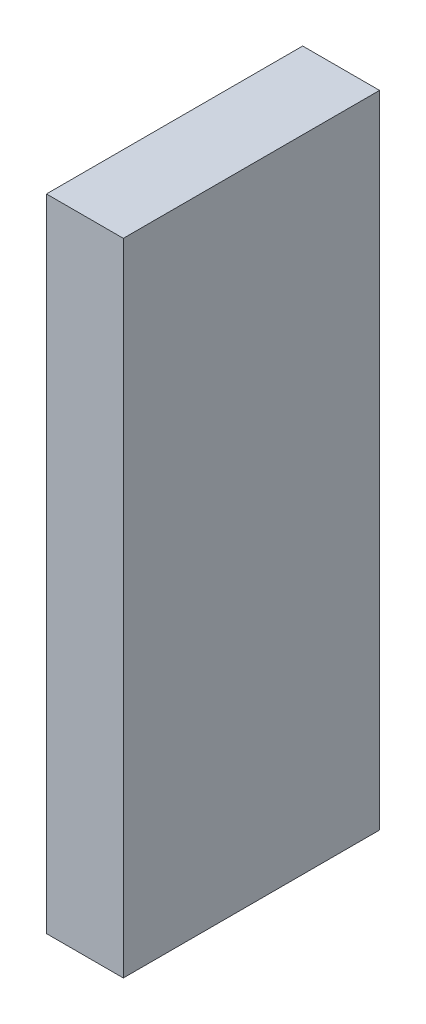
ISO-10303-21;
HEADER;
FILE_DESCRIPTION(('STEP AP214'),'2;1');
FILE_NAME('part.step','',(''),(''),'','','');
FILE_SCHEMA(('AUTOMOTIVE_DESIGN { 1 0 10303 214 1 1 1 1 }'));
ENDSEC;
DATA;
#1=APPLICATION_CONTEXT('core data for automotive mechanical design processes');
#2=APPLICATION_PROTOCOL_DEFINITION('international standard','automotive_design',2000,#1);
#3=PRODUCT_CONTEXT('',#1,'mechanical');
#4=PRODUCT('Part','Part','',(#3));
#5=PRODUCT_RELATED_PRODUCT_CATEGORY('part','',(#4));
#6=PRODUCT_DEFINITION_FORMATION('','',#4);
#7=PRODUCT_DEFINITION_CONTEXT('part definition',#1,'design');
#8=PRODUCT_DEFINITION('design','',#6,#7);
#9=PRODUCT_DEFINITION_SHAPE('','',#8);
#10=(LENGTH_UNIT() NAMED_UNIT(*) SI_UNIT(.MILLI.,.METRE.));
#11=(NAMED_UNIT(*) PLANE_ANGLE_UNIT() SI_UNIT($,.RADIAN.));
#12=(NAMED_UNIT(*) SI_UNIT($,.STERADIAN.) SOLID_ANGLE_UNIT());
#13=UNCERTAINTY_MEASURE_WITH_UNIT(LENGTH_MEASURE(1.E-05),#10,'distance_accuracy_value','');
#14=(GEOMETRIC_REPRESENTATION_CONTEXT(3) GLOBAL_UNCERTAINTY_ASSIGNED_CONTEXT((#13)) GLOBAL_UNIT_ASSIGNED_CONTEXT((#10,
#11,#12)) REPRESENTATION_CONTEXT('',''));
#15=CARTESIAN_POINT('',(0.,0.,0.));
#16=DIRECTION('',(0.,0.,1.));
#17=DIRECTION('',(1.,0.,0.));
#18=AXIS2_PLACEMENT_3D('',#15,#16,#17);
#19=CARTESIAN_POINT('',(0.,25.,56.1884162782189));
#20=DIRECTION('',(0.,0.,1.));
#21=DIRECTION('',(1.,0.,0.));
#22=AXIS2_PLACEMENT_3D('',#19,#20,#21);
#23=PLANE('',#22);
#24=DIRECTION('',(-1.,0.,0.));
#25=VECTOR('',#24,1.);
#26=CARTESIAN_POINT('',(0.,0.,56.1884162782189));
#27=LINE('',#26,#25);
#28=CARTESIAN_POINT('',(-6.62971669111983,0.,56.1884162782189));
#29=VERTEX_POINT('',#28);
#30=CARTESIAN_POINT('',(-9.62971669111982,0.,56.1884162782189));
#31=VERTEX_POINT('',#30);
#32=EDGE_CURVE('E98',#29,#31,#27,.T.);
#33=ORIENTED_EDGE('',*,*,#32,.T.);
#34=DIRECTION('',(0.,-1.,0.));
#35=VECTOR('',#34,1.);
#36=CARTESIAN_POINT('',(-9.62971669111982,25.,56.1884162782189));
#37=LINE('',#36,#35);
#38=CARTESIAN_POINT('',(-9.62971669111982,25.,56.1884162782189));
#39=VERTEX_POINT('',#38);
#40=EDGE_CURVE('E11',#39,#31,#37,.T.);
#41=ORIENTED_EDGE('',*,*,#40,.F.);
#42=DIRECTION('',(-1.,0.,0.));
#43=VECTOR('',#42,1.);
#44=CARTESIAN_POINT('',(0.,25.,56.1884162782189));
#45=LINE('',#44,#43);
#46=CARTESIAN_POINT('',(-6.62971669111983,25.,56.1884162782189));
#47=VERTEX_POINT('',#46);
#48=EDGE_CURVE('E84',#47,#39,#45,.T.);
#49=ORIENTED_EDGE('',*,*,#48,.F.);
#50=DIRECTION('',(0.,-1.,0.));
#51=VECTOR('',#50,1.);
#52=CARTESIAN_POINT('',(-6.62971669111983,25.,56.1884162782189));
#53=LINE('',#52,#51);
#54=EDGE_CURVE('E51',#47,#29,#53,.T.);
#55=ORIENTED_EDGE('',*,*,#54,.T.);
#56=EDGE_LOOP('',(#33,#41,#49,#55));
#57=FACE_BOUND('',#56,.T.);
#58=ADVANCED_FACE('F35',(#57),#23,.F.);
#59=CARTESIAN_POINT('',(-9.62971669111984,25.,0.));
#60=DIRECTION('',(1.,0.,0.));
#61=DIRECTION('',(0.,0.,-1.));
#62=AXIS2_PLACEMENT_3D('',#59,#60,#61);
#63=PLANE('',#62);
#64=DIRECTION('',(0.,0.,1.));
#65=VECTOR('',#64,1.);
#66=CARTESIAN_POINT('',(-9.62971669111984,0.,0.));
#67=LINE('',#66,#65);
#68=CARTESIAN_POINT('',(-9.62971669111982,0.,66.1884162782189));
#69=VERTEX_POINT('',#68);
#70=EDGE_CURVE('E89',#31,#69,#67,.T.);
#71=ORIENTED_EDGE('',*,*,#70,.T.);
#72=DIRECTION('',(0.,-1.,0.));
#73=VECTOR('',#72,1.);
#74=CARTESIAN_POINT('',(-9.62971669111982,25.,66.1884162782189));
#75=LINE('',#74,#73);
#76=CARTESIAN_POINT('',(-9.62971669111982,25.,66.1884162782189));
#77=VERTEX_POINT('',#76);
#78=EDGE_CURVE('E43',#77,#69,#75,.T.);
#79=ORIENTED_EDGE('',*,*,#78,.F.);
#80=DIRECTION('',(0.,0.,1.));
#81=VECTOR('',#80,1.);
#82=CARTESIAN_POINT('',(-9.62971669111984,25.,0.));
#83=LINE('',#82,#81);
#84=EDGE_CURVE('E76',#39,#77,#83,.T.);
#85=ORIENTED_EDGE('',*,*,#84,.F.);
#86=ORIENTED_EDGE('',*,*,#40,.T.);
#87=EDGE_LOOP('',(#71,#79,#85,#86));
#88=FACE_BOUND('',#87,.T.);
#89=ADVANCED_FACE('F88',(#88),#63,.F.);
#90=CARTESIAN_POINT('',(0.,25.,66.1884162782189));
#91=DIRECTION('',(0.,0.,1.));
#92=DIRECTION('',(1.,0.,0.));
#93=AXIS2_PLACEMENT_3D('',#90,#91,#92);
#94=PLANE('',#93);
#95=DIRECTION('',(-1.,0.,0.));
#96=VECTOR('',#95,1.);
#97=CARTESIAN_POINT('',(0.,0.,66.1884162782189));
#98=LINE('',#97,#96);
#99=CARTESIAN_POINT('',(-6.62971669111983,0.,66.1884162782189));
#100=VERTEX_POINT('',#99);
#101=EDGE_CURVE('E101',#100,#69,#98,.T.);
#102=ORIENTED_EDGE('',*,*,#101,.F.);
#103=DIRECTION('',(0.,-1.,0.));
#104=VECTOR('',#103,1.);
#105=CARTESIAN_POINT('',(-6.62971669111983,25.,66.1884162782189));
#106=LINE('',#105,#104);
#107=CARTESIAN_POINT('',(-6.62971669111983,25.,66.1884162782189));
#108=VERTEX_POINT('',#107);
#109=EDGE_CURVE('E65',#108,#100,#106,.T.);
#110=ORIENTED_EDGE('',*,*,#109,.F.);
#111=DIRECTION('',(-1.,0.,0.));
#112=VECTOR('',#111,1.);
#113=CARTESIAN_POINT('',(0.,25.,66.1884162782189));
#114=LINE('',#113,#112);
#115=EDGE_CURVE('E83',#108,#77,#114,.T.);
#116=ORIENTED_EDGE('',*,*,#115,.T.);
#117=ORIENTED_EDGE('',*,*,#78,.T.);
#118=EDGE_LOOP('',(#102,#110,#116,#117));
#119=FACE_BOUND('',#118,.T.);
#120=ADVANCED_FACE('F92',(#119),#94,.T.);
#121=CARTESIAN_POINT('',(-6.62971669111984,25.,0.));
#122=DIRECTION('',(1.,0.,0.));
#123=DIRECTION('',(0.,0.,-1.));
#124=AXIS2_PLACEMENT_3D('',#121,#122,#123);
#125=PLANE('',#124);
#126=DIRECTION('',(0.,0.,1.));
#127=VECTOR('',#126,1.);
#128=CARTESIAN_POINT('',(-6.62971669111984,0.,0.));
#129=LINE('',#128,#127);
#130=EDGE_CURVE('E103',#29,#100,#129,.T.);
#131=ORIENTED_EDGE('',*,*,#130,.F.);
#132=ORIENTED_EDGE('',*,*,#54,.F.);
#133=DIRECTION('',(0.,0.,1.));
#134=VECTOR('',#133,1.);
#135=CARTESIAN_POINT('',(-6.62971669111984,25.,0.));
#136=LINE('',#135,#134);
#137=EDGE_CURVE('E93',#47,#108,#136,.T.);
#138=ORIENTED_EDGE('',*,*,#137,.T.);
#139=ORIENTED_EDGE('',*,*,#109,.T.);
#140=EDGE_LOOP('',(#131,#132,#138,#139));
#141=FACE_BOUND('',#140,.T.);
#142=ADVANCED_FACE('F109',(#141),#125,.T.);
#143=CARTESIAN_POINT('',(0.,25.,0.));
#144=DIRECTION('',(0.,1.,0.));
#145=DIRECTION('',(0.,0.,1.));
#146=AXIS2_PLACEMENT_3D('',#143,#144,#145);
#147=PLANE('',#146);
#148=ORIENTED_EDGE('',*,*,#48,.T.);
#149=ORIENTED_EDGE('',*,*,#84,.T.);
#150=ORIENTED_EDGE('',*,*,#115,.F.);
#151=ORIENTED_EDGE('',*,*,#137,.F.);
#152=EDGE_LOOP('',(#148,#149,#150,#151));
#153=FACE_BOUND('',#152,.T.);
#154=ADVANCED_FACE('F80',(#153),#147,.T.);
#155=CARTESIAN_POINT('',(0.,0.,0.));
#156=DIRECTION('',(0.,1.,0.));
#157=DIRECTION('',(0.,0.,1.));
#158=AXIS2_PLACEMENT_3D('',#155,#156,#157);
#159=PLANE('',#158);
#160=ORIENTED_EDGE('',*,*,#32,.F.);
#161=ORIENTED_EDGE('',*,*,#130,.T.);
#162=ORIENTED_EDGE('',*,*,#101,.T.);
#163=ORIENTED_EDGE('',*,*,#70,.F.);
#164=EDGE_LOOP('',(#160,#161,#162,#163));
#165=FACE_BOUND('',#164,.T.);
#166=ADVANCED_FACE('F108',(#165),#159,.F.);
#167=CLOSED_SHELL('',(#58,#89,#120,#142,#154,#166));
#168=MANIFOLD_SOLID_BREP('B2',#167);
#169=ADVANCED_BREP_SHAPE_REPRESENTATION('',(#18,#168),#14);
#170=SHAPE_DEFINITION_REPRESENTATION(#9,#169);
ENDSEC;
END-ISO-10303-21;
